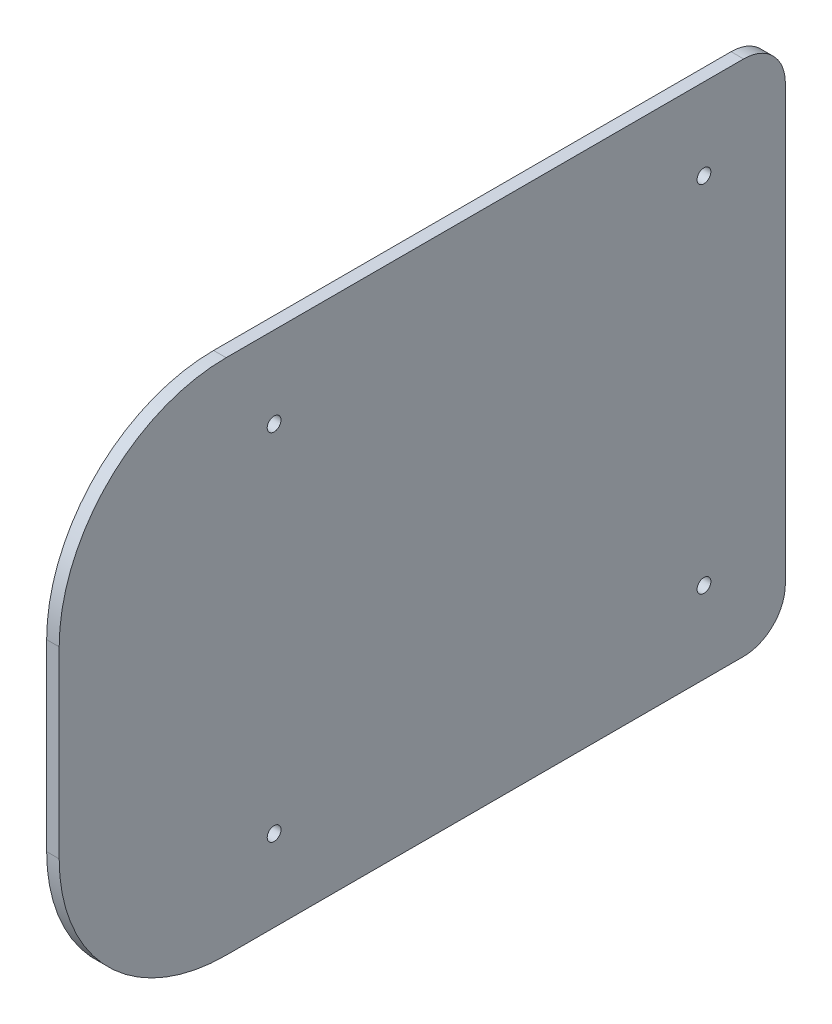
ISO-10303-21;
HEADER;
FILE_DESCRIPTION(('STEP AP214'),'2;1');
FILE_NAME('part.step','',(''),(''),'','','');
FILE_SCHEMA(('AUTOMOTIVE_DESIGN { 1 0 10303 214 1 1 1 1 }'));
ENDSEC;
DATA;
#1=APPLICATION_CONTEXT('core data for automotive mechanical design processes');
#2=APPLICATION_PROTOCOL_DEFINITION('international standard','automotive_design',2000,#1);
#3=PRODUCT_CONTEXT('',#1,'mechanical');
#4=PRODUCT('Part','Part','',(#3));
#5=PRODUCT_RELATED_PRODUCT_CATEGORY('part','',(#4));
#6=PRODUCT_DEFINITION_FORMATION('','',#4);
#7=PRODUCT_DEFINITION_CONTEXT('part definition',#1,'design');
#8=PRODUCT_DEFINITION('design','',#6,#7);
#9=PRODUCT_DEFINITION_SHAPE('','',#8);
#10=(LENGTH_UNIT() NAMED_UNIT(*) SI_UNIT(.MILLI.,.METRE.));
#11=(NAMED_UNIT(*) PLANE_ANGLE_UNIT() SI_UNIT($,.RADIAN.));
#12=(NAMED_UNIT(*) SI_UNIT($,.STERADIAN.) SOLID_ANGLE_UNIT());
#13=UNCERTAINTY_MEASURE_WITH_UNIT(LENGTH_MEASURE(1.E-05),#10,'distance_accuracy_value','');
#14=(GEOMETRIC_REPRESENTATION_CONTEXT(3) GLOBAL_UNCERTAINTY_ASSIGNED_CONTEXT((#13)) GLOBAL_UNIT_ASSIGNED_CONTEXT((#10,
#11,#12)) REPRESENTATION_CONTEXT('',''));
#15=CARTESIAN_POINT('',(0.,0.,0.));
#16=DIRECTION('',(0.,0.,1.));
#17=DIRECTION('',(1.,0.,0.));
#18=AXIS2_PLACEMENT_3D('',#15,#16,#17);
#19=CARTESIAN_POINT('',(0.,0.,0.));
#20=DIRECTION('',(1.,0.,0.));
#21=DIRECTION('',(0.,0.,-1.));
#22=AXIS2_PLACEMENT_3D('',#19,#20,#21);
#23=PLANE('',#22);
#24=CARTESIAN_POINT('',(0.,52.,10.));
#25=DIRECTION('',(-1.,0.,0.));
#26=DIRECTION('',(0.,0.,1.));
#27=AXIS2_PLACEMENT_3D('',#24,#25,#26);
#28=CIRCLE('',#27,10.);
#29=CARTESIAN_POINT('',(0.,52.,0.));
#30=VERTEX_POINT('',#29);
#31=CARTESIAN_POINT('',(0.,62.,10.));
#32=VERTEX_POINT('',#31);
#33=EDGE_CURVE('E152',#30,#32,#28,.F.);
#34=ORIENTED_EDGE('',*,*,#33,.F.);
#35=DIRECTION('',(0.,1.,0.));
#36=VECTOR('',#35,1.);
#37=CARTESIAN_POINT('',(0.,-62.,0.));
#38=LINE('',#37,#36);
#39=CARTESIAN_POINT('',(0.,-52.,0.));
#40=VERTEX_POINT('',#39);
#41=EDGE_CURVE('E109',#40,#30,#38,.T.);
#42=ORIENTED_EDGE('',*,*,#41,.F.);
#43=CARTESIAN_POINT('',(0.,-52.,10.));
#44=DIRECTION('',(-1.,0.,0.));
#45=DIRECTION('',(0.,0.,1.));
#46=AXIS2_PLACEMENT_3D('',#43,#44,#45);
#47=CIRCLE('',#46,10.);
#48=CARTESIAN_POINT('',(0.,-62.,10.));
#49=VERTEX_POINT('',#48);
#50=EDGE_CURVE('E155',#49,#40,#47,.F.);
#51=ORIENTED_EDGE('',*,*,#50,.F.);
#52=DIRECTION('',(0.,0.,-1.));
#53=VECTOR('',#52,1.);
#54=CARTESIAN_POINT('',(0.,-62.,174.));
#55=LINE('',#54,#53);
#56=CARTESIAN_POINT('',(0.,-62.,134.));
#57=VERTEX_POINT('',#56);
#58=EDGE_CURVE('E114',#57,#49,#55,.T.);
#59=ORIENTED_EDGE('',*,*,#58,.F.);
#60=CARTESIAN_POINT('',(0.,-22.,134.));
#61=DIRECTION('',(-1.,0.,0.));
#62=DIRECTION('',(0.,0.,1.));
#63=AXIS2_PLACEMENT_3D('',#60,#61,#62);
#64=CIRCLE('',#63,40.);
#65=CARTESIAN_POINT('',(0.,-22.,174.));
#66=VERTEX_POINT('',#65);
#67=EDGE_CURVE('E95',#66,#57,#64,.F.);
#68=ORIENTED_EDGE('',*,*,#67,.F.);
#69=DIRECTION('',(0.,1.,0.));
#70=VECTOR('',#69,1.);
#71=CARTESIAN_POINT('',(0.,62.,174.));
#72=LINE('',#71,#70);
#73=CARTESIAN_POINT('',(0.,22.,174.));
#74=VERTEX_POINT('',#73);
#75=EDGE_CURVE('E91',#74,#66,#72,.F.);
#76=ORIENTED_EDGE('',*,*,#75,.F.);
#77=CARTESIAN_POINT('',(0.,22.,134.));
#78=DIRECTION('',(-1.,0.,0.));
#79=DIRECTION('',(0.,0.,1.));
#80=AXIS2_PLACEMENT_3D('',#77,#78,#79);
#81=CIRCLE('',#80,40.);
#82=CARTESIAN_POINT('',(0.,62.,134.));
#83=VERTEX_POINT('',#82);
#84=EDGE_CURVE('E19',#83,#74,#81,.F.);
#85=ORIENTED_EDGE('',*,*,#84,.F.);
#86=DIRECTION('',(0.,0.,1.));
#87=VECTOR('',#86,1.);
#88=CARTESIAN_POINT('',(0.,62.,0.));
#89=LINE('',#88,#87);
#90=EDGE_CURVE('E77',#32,#83,#89,.T.);
#91=ORIENTED_EDGE('',*,*,#90,.F.);
#92=EDGE_LOOP('',(#34,#42,#51,#59,#68,#76,#85,#91));
#93=FACE_BOUND('',#92,.T.);
#94=CARTESIAN_POINT('',(0.,42.5,122.5));
#95=DIRECTION('',(1.,0.,0.));
#96=DIRECTION('',(0.,0.,-1.));
#97=AXIS2_PLACEMENT_3D('',#94,#95,#96);
#98=CIRCLE('',#97,1.65);
#99=CARTESIAN_POINT('',(0.,42.5,120.85));
#100=VERTEX_POINT('',#99);
#101=EDGE_CURVE('E140',#100,#100,#98,.T.);
#102=ORIENTED_EDGE('',*,*,#101,.T.);
#103=EDGE_LOOP('',(#102));
#104=FACE_BOUND('',#103,.T.);
#105=CARTESIAN_POINT('',(0.,42.5,19.5));
#106=DIRECTION('',(1.,0.,0.));
#107=DIRECTION('',(0.,0.,-1.));
#108=AXIS2_PLACEMENT_3D('',#105,#106,#107);
#109=CIRCLE('',#108,1.65);
#110=CARTESIAN_POINT('',(0.,42.5,17.85));
#111=VERTEX_POINT('',#110);
#112=EDGE_CURVE('E143',#111,#111,#109,.T.);
#113=ORIENTED_EDGE('',*,*,#112,.T.);
#114=EDGE_LOOP('',(#113));
#115=FACE_BOUND('',#114,.T.);
#116=CARTESIAN_POINT('',(0.,-42.5,122.5));
#117=DIRECTION('',(1.,0.,0.));
#118=DIRECTION('',(0.,0.,-1.));
#119=AXIS2_PLACEMENT_3D('',#116,#117,#118);
#120=CIRCLE('',#119,1.65);
#121=CARTESIAN_POINT('',(0.,-42.5,120.85));
#122=VERTEX_POINT('',#121);
#123=EDGE_CURVE('E146',#122,#122,#120,.T.);
#124=ORIENTED_EDGE('',*,*,#123,.T.);
#125=EDGE_LOOP('',(#124));
#126=FACE_BOUND('',#125,.T.);
#127=CARTESIAN_POINT('',(0.,-42.5,19.5));
#128=DIRECTION('',(1.,0.,0.));
#129=DIRECTION('',(0.,0.,-1.));
#130=AXIS2_PLACEMENT_3D('',#127,#128,#129);
#131=CIRCLE('',#130,1.65);
#132=CARTESIAN_POINT('',(0.,-42.5,17.85));
#133=VERTEX_POINT('',#132);
#134=EDGE_CURVE('E149',#133,#133,#131,.T.);
#135=ORIENTED_EDGE('',*,*,#134,.T.);
#136=EDGE_LOOP('',(#135));
#137=FACE_BOUND('',#136,.T.);
#138=ADVANCED_FACE('F16',(#93,#104,#115,#126,#137),#23,.F.);
#139=CARTESIAN_POINT('',(0.,62.,0.));
#140=DIRECTION('',(0.,1.,0.));
#141=DIRECTION('',(0.,0.,1.));
#142=AXIS2_PLACEMENT_3D('',#139,#140,#141);
#143=PLANE('',#142);
#144=DIRECTION('',(0.,0.,-1.));
#145=VECTOR('',#144,1.);
#146=CARTESIAN_POINT('',(3.,62.,0.));
#147=LINE('',#146,#145);
#148=CARTESIAN_POINT('',(3.,62.,10.));
#149=VERTEX_POINT('',#148);
#150=CARTESIAN_POINT('',(3.,62.,134.));
#151=VERTEX_POINT('',#150);
#152=EDGE_CURVE('E139',#149,#151,#147,.F.);
#153=ORIENTED_EDGE('',*,*,#152,.F.);
#154=DIRECTION('',(-1.,0.,0.));
#155=VECTOR('',#154,1.);
#156=CARTESIAN_POINT('',(3.15648,62.,10.));
#157=LINE('',#156,#155);
#158=EDGE_CURVE('E111',#32,#149,#157,.F.);
#159=ORIENTED_EDGE('',*,*,#158,.F.);
#160=ORIENTED_EDGE('',*,*,#90,.T.);
#161=DIRECTION('',(-1.,0.,0.));
#162=VECTOR('',#161,1.);
#163=CARTESIAN_POINT('',(3.15648,62.,134.));
#164=LINE('',#163,#162);
#165=EDGE_CURVE('E88',#151,#83,#164,.T.);
#166=ORIENTED_EDGE('',*,*,#165,.F.);
#167=EDGE_LOOP('',(#153,#159,#160,#166));
#168=FACE_BOUND('',#167,.T.);
#169=ADVANCED_FACE('F187',(#168),#143,.T.);
#170=CARTESIAN_POINT('',(3.15648,22.,134.));
#171=DIRECTION('',(-1.,0.,0.));
#172=DIRECTION('',(0.,0.,1.));
#173=AXIS2_PLACEMENT_3D('',#170,#171,#172);
#174=CYLINDRICAL_SURFACE('',#173,40.);
#175=ORIENTED_EDGE('',*,*,#165,.T.);
#176=ORIENTED_EDGE('',*,*,#84,.T.);
#177=DIRECTION('',(1.,0.,0.));
#178=VECTOR('',#177,1.);
#179=CARTESIAN_POINT('',(0.,22.,174.));
#180=LINE('',#179,#178);
#181=CARTESIAN_POINT('',(3.,22.,174.));
#182=VERTEX_POINT('',#181);
#183=EDGE_CURVE('E86',#182,#74,#180,.F.);
#184=ORIENTED_EDGE('',*,*,#183,.F.);
#185=CARTESIAN_POINT('',(3.,22.,134.));
#186=DIRECTION('',(-1.,0.,0.));
#187=DIRECTION('',(0.,0.,1.));
#188=AXIS2_PLACEMENT_3D('',#185,#186,#187);
#189=CIRCLE('',#188,40.);
#190=EDGE_CURVE('E137',#151,#182,#189,.F.);
#191=ORIENTED_EDGE('',*,*,#190,.F.);
#192=EDGE_LOOP('',(#175,#176,#184,#191));
#193=FACE_BOUND('',#192,.T.);
#194=ADVANCED_FACE('F83',(#193),#174,.T.);
#195=CARTESIAN_POINT('',(0.,62.,174.));
#196=DIRECTION('',(0.,0.,1.));
#197=DIRECTION('',(1.,0.,0.));
#198=AXIS2_PLACEMENT_3D('',#195,#196,#197);
#199=PLANE('',#198);
#200=ORIENTED_EDGE('',*,*,#75,.T.);
#201=DIRECTION('',(-1.,0.,0.));
#202=VECTOR('',#201,1.);
#203=CARTESIAN_POINT('',(3.15648,-22.,174.));
#204=LINE('',#203,#202);
#205=CARTESIAN_POINT('',(3.,-22.,174.));
#206=VERTEX_POINT('',#205);
#207=EDGE_CURVE('E98',#206,#66,#204,.T.);
#208=ORIENTED_EDGE('',*,*,#207,.F.);
#209=DIRECTION('',(0.,1.,0.));
#210=VECTOR('',#209,1.);
#211=CARTESIAN_POINT('',(3.,0.,174.));
#212=LINE('',#211,#210);
#213=EDGE_CURVE('E102',#182,#206,#212,.F.);
#214=ORIENTED_EDGE('',*,*,#213,.F.);
#215=ORIENTED_EDGE('',*,*,#183,.T.);
#216=EDGE_LOOP('',(#200,#208,#214,#215));
#217=FACE_BOUND('',#216,.T.);
#218=ADVANCED_FACE('F100',(#217),#199,.T.);
#219=CARTESIAN_POINT('',(3.15648,-22.,134.));
#220=DIRECTION('',(-1.,0.,0.));
#221=DIRECTION('',(0.,0.,1.));
#222=AXIS2_PLACEMENT_3D('',#219,#220,#221);
#223=CYLINDRICAL_SURFACE('',#222,40.);
#224=ORIENTED_EDGE('',*,*,#207,.T.);
#225=ORIENTED_EDGE('',*,*,#67,.T.);
#226=DIRECTION('',(1.,0.,0.));
#227=VECTOR('',#226,1.);
#228=CARTESIAN_POINT('',(0.,-62.,134.));
#229=LINE('',#228,#227);
#230=CARTESIAN_POINT('',(3.,-62.,134.));
#231=VERTEX_POINT('',#230);
#232=EDGE_CURVE('E116',#231,#57,#229,.F.);
#233=ORIENTED_EDGE('',*,*,#232,.F.);
#234=CARTESIAN_POINT('',(3.,-22.,134.));
#235=DIRECTION('',(-1.,0.,0.));
#236=DIRECTION('',(0.,0.,1.));
#237=AXIS2_PLACEMENT_3D('',#234,#235,#236);
#238=CIRCLE('',#237,40.);
#239=EDGE_CURVE('E134',#206,#231,#238,.F.);
#240=ORIENTED_EDGE('',*,*,#239,.F.);
#241=EDGE_LOOP('',(#224,#225,#233,#240));
#242=FACE_BOUND('',#241,.T.);
#243=ADVANCED_FACE('F159',(#242),#223,.T.);
#244=CARTESIAN_POINT('',(0.,-62.,174.));
#245=DIRECTION('',(0.,-1.,0.));
#246=DIRECTION('',(0.,0.,-1.));
#247=AXIS2_PLACEMENT_3D('',#244,#245,#246);
#248=PLANE('',#247);
#249=ORIENTED_EDGE('',*,*,#58,.T.);
#250=DIRECTION('',(-1.,0.,0.));
#251=VECTOR('',#250,1.);
#252=CARTESIAN_POINT('',(3.15648,-62.,10.));
#253=LINE('',#252,#251);
#254=CARTESIAN_POINT('',(3.,-62.,10.));
#255=VERTEX_POINT('',#254);
#256=EDGE_CURVE('E115',#255,#49,#253,.T.);
#257=ORIENTED_EDGE('',*,*,#256,.F.);
#258=DIRECTION('',(0.,0.,-1.));
#259=VECTOR('',#258,1.);
#260=CARTESIAN_POINT('',(3.,-62.,0.));
#261=LINE('',#260,#259);
#262=EDGE_CURVE('E133',#231,#255,#261,.T.);
#263=ORIENTED_EDGE('',*,*,#262,.F.);
#264=ORIENTED_EDGE('',*,*,#232,.T.);
#265=EDGE_LOOP('',(#249,#257,#263,#264));
#266=FACE_BOUND('',#265,.T.);
#267=ADVANCED_FACE('F183',(#266),#248,.T.);
#268=CARTESIAN_POINT('',(3.15648,-52.,10.));
#269=DIRECTION('',(-1.,0.,0.));
#270=DIRECTION('',(0.,0.,1.));
#271=AXIS2_PLACEMENT_3D('',#268,#269,#270);
#272=CYLINDRICAL_SURFACE('',#271,10.);
#273=ORIENTED_EDGE('',*,*,#256,.T.);
#274=ORIENTED_EDGE('',*,*,#50,.T.);
#275=DIRECTION('',(-1.,0.,0.));
#276=VECTOR('',#275,1.);
#277=CARTESIAN_POINT('',(0.,-52.,0.));
#278=LINE('',#277,#276);
#279=CARTESIAN_POINT('',(3.,-52.,0.));
#280=VERTEX_POINT('',#279);
#281=EDGE_CURVE('E112',#280,#40,#278,.T.);
#282=ORIENTED_EDGE('',*,*,#281,.F.);
#283=CARTESIAN_POINT('',(3.,-52.,10.));
#284=DIRECTION('',(-1.,0.,0.));
#285=DIRECTION('',(0.,0.,1.));
#286=AXIS2_PLACEMENT_3D('',#283,#284,#285);
#287=CIRCLE('',#286,10.);
#288=EDGE_CURVE('E130',#255,#280,#287,.F.);
#289=ORIENTED_EDGE('',*,*,#288,.F.);
#290=EDGE_LOOP('',(#273,#274,#282,#289));
#291=FACE_BOUND('',#290,.T.);
#292=ADVANCED_FACE('F179',(#291),#272,.T.);
#293=CARTESIAN_POINT('',(0.,-62.,0.));
#294=DIRECTION('',(0.,0.,-1.));
#295=DIRECTION('',(-1.,0.,0.));
#296=AXIS2_PLACEMENT_3D('',#293,#294,#295);
#297=PLANE('',#296);
#298=ORIENTED_EDGE('',*,*,#41,.T.);
#299=DIRECTION('',(-1.,0.,0.));
#300=VECTOR('',#299,1.);
#301=CARTESIAN_POINT('',(3.15648,52.,0.));
#302=LINE('',#301,#300);
#303=CARTESIAN_POINT('',(3.,52.,0.));
#304=VERTEX_POINT('',#303);
#305=EDGE_CURVE('E34',#304,#30,#302,.T.);
#306=ORIENTED_EDGE('',*,*,#305,.F.);
#307=DIRECTION('',(0.,1.,0.));
#308=VECTOR('',#307,1.);
#309=CARTESIAN_POINT('',(3.,0.,0.));
#310=LINE('',#309,#308);
#311=EDGE_CURVE('E129',#280,#304,#310,.T.);
#312=ORIENTED_EDGE('',*,*,#311,.F.);
#313=ORIENTED_EDGE('',*,*,#281,.T.);
#314=EDGE_LOOP('',(#298,#306,#312,#313));
#315=FACE_BOUND('',#314,.T.);
#316=ADVANCED_FACE('F184',(#315),#297,.T.);
#317=CARTESIAN_POINT('',(3.15648,52.,10.));
#318=DIRECTION('',(-1.,0.,0.));
#319=DIRECTION('',(0.,0.,1.));
#320=AXIS2_PLACEMENT_3D('',#317,#318,#319);
#321=CYLINDRICAL_SURFACE('',#320,10.);
#322=ORIENTED_EDGE('',*,*,#305,.T.);
#323=ORIENTED_EDGE('',*,*,#33,.T.);
#324=ORIENTED_EDGE('',*,*,#158,.T.);
#325=CARTESIAN_POINT('',(3.,52.,10.));
#326=DIRECTION('',(-1.,0.,0.));
#327=DIRECTION('',(0.,0.,1.));
#328=AXIS2_PLACEMENT_3D('',#325,#326,#327);
#329=CIRCLE('',#328,10.);
#330=EDGE_CURVE('E126',#304,#149,#329,.F.);
#331=ORIENTED_EDGE('',*,*,#330,.F.);
#332=EDGE_LOOP('',(#322,#323,#324,#331));
#333=FACE_BOUND('',#332,.T.);
#334=ADVANCED_FACE('F186',(#333),#321,.T.);
#335=CARTESIAN_POINT('',(-84.83438166172,-42.5,19.5));
#336=DIRECTION('',(1.,0.,0.));
#337=DIRECTION('',(0.,0.,-1.));
#338=AXIS2_PLACEMENT_3D('',#335,#336,#337);
#339=CYLINDRICAL_SURFACE('',#338,1.65);
#340=CARTESIAN_POINT('',(3.,-42.5,19.5));
#341=DIRECTION('',(1.,0.,0.));
#342=DIRECTION('',(0.,0.,-1.));
#343=AXIS2_PLACEMENT_3D('',#340,#341,#342);
#344=CIRCLE('',#343,1.65);
#345=CARTESIAN_POINT('',(3.,-42.5,17.85));
#346=VERTEX_POINT('',#345);
#347=EDGE_CURVE('E123',#346,#346,#344,.F.);
#348=ORIENTED_EDGE('',*,*,#347,.F.);
#349=EDGE_LOOP('',(#348));
#350=FACE_BOUND('',#349,.T.);
#351=ORIENTED_EDGE('',*,*,#134,.F.);
#352=EDGE_LOOP('',(#351));
#353=FACE_BOUND('',#352,.T.);
#354=ADVANCED_FACE('F215',(#350,#353),#339,.F.);
#355=CARTESIAN_POINT('',(-84.93296307851,-42.5,122.5));
#356=DIRECTION('',(1.,0.,0.));
#357=DIRECTION('',(0.,0.,-1.));
#358=AXIS2_PLACEMENT_3D('',#355,#356,#357);
#359=CYLINDRICAL_SURFACE('',#358,1.65);
#360=CARTESIAN_POINT('',(3.,-42.5,122.5));
#361=DIRECTION('',(1.,0.,0.));
#362=DIRECTION('',(0.,0.,-1.));
#363=AXIS2_PLACEMENT_3D('',#360,#361,#362);
#364=CIRCLE('',#363,1.65);
#365=CARTESIAN_POINT('',(3.,-42.5,120.85));
#366=VERTEX_POINT('',#365);
#367=EDGE_CURVE('E120',#366,#366,#364,.F.);
#368=ORIENTED_EDGE('',*,*,#367,.F.);
#369=EDGE_LOOP('',(#368));
#370=FACE_BOUND('',#369,.T.);
#371=ORIENTED_EDGE('',*,*,#123,.F.);
#372=EDGE_LOOP('',(#371));
#373=FACE_BOUND('',#372,.T.);
#374=ADVANCED_FACE('F211',(#370,#373),#359,.F.);
#375=CARTESIAN_POINT('',(-84.93296307851,42.5,19.5));
#376=DIRECTION('',(1.,0.,0.));
#377=DIRECTION('',(0.,0.,-1.));
#378=AXIS2_PLACEMENT_3D('',#375,#376,#377);
#379=CYLINDRICAL_SURFACE('',#378,1.65);
#380=CARTESIAN_POINT('',(3.,42.5,19.5));
#381=DIRECTION('',(1.,0.,0.));
#382=DIRECTION('',(0.,0.,-1.));
#383=AXIS2_PLACEMENT_3D('',#380,#381,#382);
#384=CIRCLE('',#383,1.65);
#385=CARTESIAN_POINT('',(3.,42.5,17.85));
#386=VERTEX_POINT('',#385);
#387=EDGE_CURVE('E25',#386,#386,#384,.F.);
#388=ORIENTED_EDGE('',*,*,#387,.F.);
#389=EDGE_LOOP('',(#388));
#390=FACE_BOUND('',#389,.T.);
#391=ORIENTED_EDGE('',*,*,#112,.F.);
#392=EDGE_LOOP('',(#391));
#393=FACE_BOUND('',#392,.T.);
#394=ADVANCED_FACE('F204',(#390,#393),#379,.F.);
#395=CARTESIAN_POINT('',(-84.93296307851,42.5,122.5));
#396=DIRECTION('',(1.,0.,0.));
#397=DIRECTION('',(0.,0.,-1.));
#398=AXIS2_PLACEMENT_3D('',#395,#396,#397);
#399=CYLINDRICAL_SURFACE('',#398,1.65);
#400=CARTESIAN_POINT('',(3.,42.5,122.5));
#401=DIRECTION('',(1.,0.,0.));
#402=DIRECTION('',(0.,0.,-1.));
#403=AXIS2_PLACEMENT_3D('',#400,#401,#402);
#404=CIRCLE('',#403,1.65);
#405=CARTESIAN_POINT('',(3.,42.5,120.85));
#406=VERTEX_POINT('',#405);
#407=EDGE_CURVE('E11',#406,#406,#404,.F.);
#408=ORIENTED_EDGE('',*,*,#407,.F.);
#409=EDGE_LOOP('',(#408));
#410=FACE_BOUND('',#409,.T.);
#411=ORIENTED_EDGE('',*,*,#101,.F.);
#412=EDGE_LOOP('',(#411));
#413=FACE_BOUND('',#412,.T.);
#414=ADVANCED_FACE('F197',(#410,#413),#399,.F.);
#415=CARTESIAN_POINT('',(3.,0.,0.));
#416=DIRECTION('',(1.,0.,0.));
#417=DIRECTION('',(0.,0.,-1.));
#418=AXIS2_PLACEMENT_3D('',#415,#416,#417);
#419=PLANE('',#418);
#420=ORIENTED_EDGE('',*,*,#407,.T.);
#421=EDGE_LOOP('',(#420));
#422=FACE_BOUND('',#421,.T.);
#423=ORIENTED_EDGE('',*,*,#387,.T.);
#424=EDGE_LOOP('',(#423));
#425=FACE_BOUND('',#424,.T.);
#426=ORIENTED_EDGE('',*,*,#367,.T.);
#427=EDGE_LOOP('',(#426));
#428=FACE_BOUND('',#427,.T.);
#429=ORIENTED_EDGE('',*,*,#347,.T.);
#430=EDGE_LOOP('',(#429));
#431=FACE_BOUND('',#430,.T.);
#432=ORIENTED_EDGE('',*,*,#311,.T.);
#433=ORIENTED_EDGE('',*,*,#330,.T.);
#434=ORIENTED_EDGE('',*,*,#152,.T.);
#435=ORIENTED_EDGE('',*,*,#190,.T.);
#436=ORIENTED_EDGE('',*,*,#213,.T.);
#437=ORIENTED_EDGE('',*,*,#239,.T.);
#438=ORIENTED_EDGE('',*,*,#262,.T.);
#439=ORIENTED_EDGE('',*,*,#288,.T.);
#440=EDGE_LOOP('',(#432,#433,#434,#435,#436,#437,#438,#439));
#441=FACE_BOUND('',#440,.T.);
#442=ADVANCED_FACE('F164',(#422,#425,#428,#431,#441),#419,.T.);
#443=CLOSED_SHELL('',(#138,#169,#194,#218,#243,#267,#292,#316,#334,#354,#374,#394,#414,#442));
#444=MANIFOLD_SOLID_BREP('B1',#443);
#445=ADVANCED_BREP_SHAPE_REPRESENTATION('',(#18,#444),#14);
#446=SHAPE_DEFINITION_REPRESENTATION(#9,#445);
ENDSEC;
END-ISO-10303-21;
